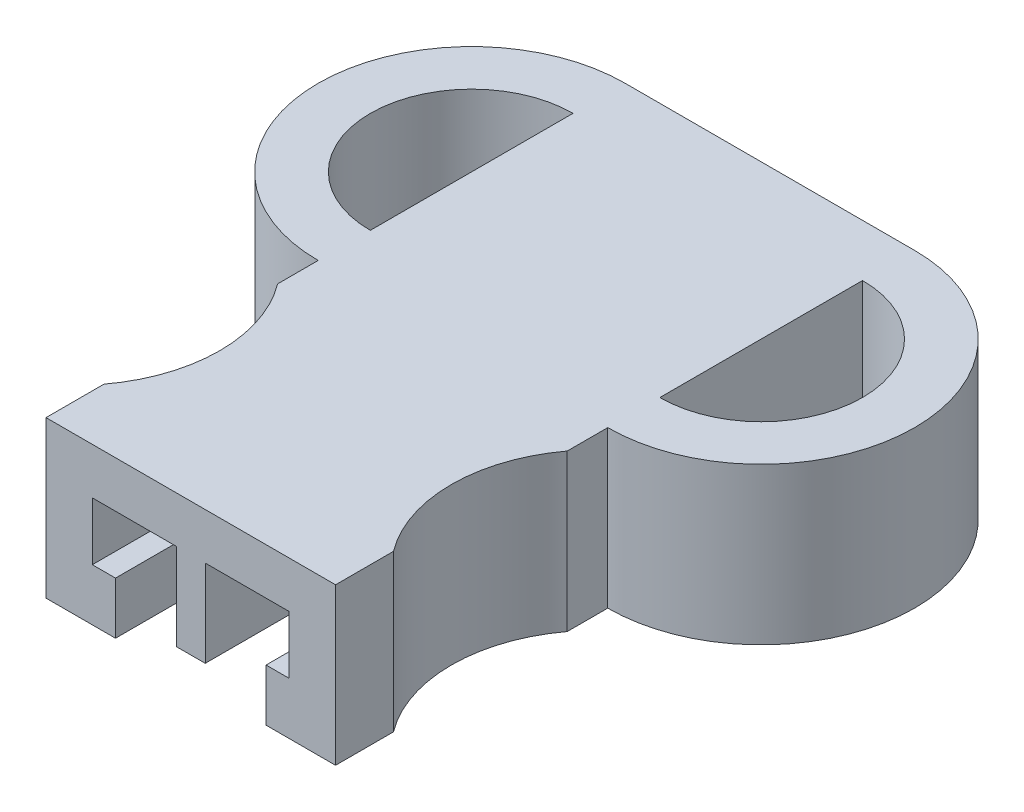
ISO-10303-21;
HEADER;
FILE_DESCRIPTION(('STEP AP214'),'2;1');
FILE_NAME('part.step','',(''),(''),'','','');
FILE_SCHEMA(('AUTOMOTIVE_DESIGN { 1 0 10303 214 1 1 1 1 }'));
ENDSEC;
DATA;
#1=APPLICATION_CONTEXT('core data for automotive mechanical design processes');
#2=APPLICATION_PROTOCOL_DEFINITION('international standard','automotive_design',2000,#1);
#3=PRODUCT_CONTEXT('',#1,'mechanical');
#4=PRODUCT('Part','Part','',(#3));
#5=PRODUCT_RELATED_PRODUCT_CATEGORY('part','',(#4));
#6=PRODUCT_DEFINITION_FORMATION('','',#4);
#7=PRODUCT_DEFINITION_CONTEXT('part definition',#1,'design');
#8=PRODUCT_DEFINITION('design','',#6,#7);
#9=PRODUCT_DEFINITION_SHAPE('','',#8);
#10=(LENGTH_UNIT() NAMED_UNIT(*) SI_UNIT(.MILLI.,.METRE.));
#11=(NAMED_UNIT(*) PLANE_ANGLE_UNIT() SI_UNIT($,.RADIAN.));
#12=(NAMED_UNIT(*) SI_UNIT($,.STERADIAN.) SOLID_ANGLE_UNIT());
#13=UNCERTAINTY_MEASURE_WITH_UNIT(LENGTH_MEASURE(1.E-05),#10,'distance_accuracy_value','');
#14=(GEOMETRIC_REPRESENTATION_CONTEXT(3) GLOBAL_UNCERTAINTY_ASSIGNED_CONTEXT((#13)) GLOBAL_UNIT_ASSIGNED_CONTEXT((#10,
#11,#12)) REPRESENTATION_CONTEXT('',''));
#15=CARTESIAN_POINT('',(0.,0.,0.));
#16=DIRECTION('',(0.,0.,1.));
#17=DIRECTION('',(1.,0.,0.));
#18=AXIS2_PLACEMENT_3D('',#15,#16,#17);
#19=CARTESIAN_POINT('',(0.,6.858,0.));
#20=DIRECTION('',(1.,0.,0.));
#21=DIRECTION('',(0.,0.,-1.));
#22=AXIS2_PLACEMENT_3D('',#19,#20,#21);
#23=PLANE('',#22);
#24=DIRECTION('',(0.,0.,1.));
#25=VECTOR('',#24,1.);
#26=CARTESIAN_POINT('',(0.,6.858,0.));
#27=LINE('',#26,#25);
#28=CARTESIAN_POINT('',(0.,6.858,13.462));
#29=VERTEX_POINT('',#28);
#30=CARTESIAN_POINT('',(0.,6.858,15.24));
#31=VERTEX_POINT('',#30);
#32=EDGE_CURVE('E247',#29,#31,#27,.T.);
#33=ORIENTED_EDGE('',*,*,#32,.F.);
#34=DIRECTION('',(0.,1.,0.));
#35=VECTOR('',#34,1.);
#36=CARTESIAN_POINT('',(0.,0.,13.462));
#37=LINE('',#36,#35);
#38=CARTESIAN_POINT('',(0.,0.,13.462));
#39=VERTEX_POINT('',#38);
#40=EDGE_CURVE('E336',#39,#29,#37,.T.);
#41=ORIENTED_EDGE('',*,*,#40,.F.);
#42=DIRECTION('',(0.,0.,1.));
#43=VECTOR('',#42,1.);
#44=CARTESIAN_POINT('',(0.,0.,0.));
#45=LINE('',#44,#43);
#46=CARTESIAN_POINT('',(0.,0.,15.24));
#47=VERTEX_POINT('',#46);
#48=EDGE_CURVE('E268',#39,#47,#45,.T.);
#49=ORIENTED_EDGE('',*,*,#48,.T.);
#50=DIRECTION('',(0.,-1.,0.));
#51=VECTOR('',#50,1.);
#52=CARTESIAN_POINT('',(0.,6.858,15.24));
#53=LINE('',#52,#51);
#54=EDGE_CURVE('E11',#31,#47,#53,.T.);
#55=ORIENTED_EDGE('',*,*,#54,.F.);
#56=EDGE_LOOP('',(#33,#41,#49,#55));
#57=FACE_BOUND('',#56,.T.);
#58=ADVANCED_FACE('F35',(#57),#23,.F.);
#59=CARTESIAN_POINT('',(12.7,6.858,0.));
#60=DIRECTION('',(-1.,0.,0.));
#61=DIRECTION('',(0.,0.,1.));
#62=AXIS2_PLACEMENT_3D('',#59,#60,#61);
#63=PLANE('',#62);
#64=DIRECTION('',(0.,0.,-1.));
#65=VECTOR('',#64,1.);
#66=CARTESIAN_POINT('',(12.7,6.858,0.));
#67=LINE('',#66,#65);
#68=CARTESIAN_POINT('',(12.7,6.858,11.176));
#69=VERTEX_POINT('',#68);
#70=CARTESIAN_POINT('',(12.7,6.858,2.286));
#71=VERTEX_POINT('',#70);
#72=EDGE_CURVE('E261',#69,#71,#67,.T.);
#73=ORIENTED_EDGE('',*,*,#72,.F.);
#74=DIRECTION('',(0.,1.,0.));
#75=VECTOR('',#74,1.);
#76=CARTESIAN_POINT('',(12.7000000000001,0.,11.176));
#77=LINE('',#76,#75);
#78=CARTESIAN_POINT('',(12.7000000000001,0.,11.176));
#79=VERTEX_POINT('',#78);
#80=EDGE_CURVE('E424',#79,#69,#77,.T.);
#81=ORIENTED_EDGE('',*,*,#80,.F.);
#82=DIRECTION('',(0.,0.,-1.));
#83=VECTOR('',#82,1.);
#84=CARTESIAN_POINT('',(12.7,0.,0.));
#85=LINE('',#84,#83);
#86=CARTESIAN_POINT('',(12.7,0.,2.286));
#87=VERTEX_POINT('',#86);
#88=EDGE_CURVE('E284',#79,#87,#85,.T.);
#89=ORIENTED_EDGE('',*,*,#88,.T.);
#90=DIRECTION('',(0.,1.,0.));
#91=VECTOR('',#90,1.);
#92=CARTESIAN_POINT('',(12.7,0.,2.286));
#93=LINE('',#92,#91);
#94=EDGE_CURVE('E363',#87,#71,#93,.T.);
#95=ORIENTED_EDGE('',*,*,#94,.T.);
#96=EDGE_LOOP('',(#73,#81,#89,#95));
#97=FACE_BOUND('',#96,.T.);
#98=ADVANCED_FACE('F462',(#97),#63,.F.);
#99=CARTESIAN_POINT('',(-5.08,0.,19.05));
#100=DIRECTION('',(0.,1.,0.));
#101=DIRECTION('',(0.,0.,1.));
#102=AXIS2_PLACEMENT_3D('',#99,#100,#101);
#103=PLANE('',#102);
#104=CARTESIAN_POINT('',(0.,0.,2.286));
#105=VERTEX_POINT('',#104);
#106=CARTESIAN_POINT('',(0.,0.,11.176));
#107=VERTEX_POINT('',#106);
#108=EDGE_CURVE('E270',#105,#107,#45,.T.);
#109=ORIENTED_EDGE('',*,*,#108,.F.);
#110=CARTESIAN_POINT('',(0.,0.,6.731));
#111=DIRECTION('',(0.,-1.,0.));
#112=DIRECTION('',(0.,0.,1.));
#113=AXIS2_PLACEMENT_3D('',#110,#111,#112);
#114=CIRCLE('',#113,4.445);
#115=EDGE_CURVE('E341',#107,#105,#114,.T.);
#116=ORIENTED_EDGE('',*,*,#115,.F.);
#117=EDGE_LOOP('',(#109,#116));
#118=FACE_BOUND('',#117,.T.);
#119=DIRECTION('',(-1.,0.,0.));
#120=VECTOR('',#119,1.);
#121=CARTESIAN_POINT('',(0.,0.,0.));
#122=LINE('',#121,#120);
#123=CARTESIAN_POINT('',(3.048,0.,0.));
#124=VERTEX_POINT('',#123);
#125=CARTESIAN_POINT('',(0.,0.,0.));
#126=VERTEX_POINT('',#125);
#127=EDGE_CURVE('E287',#124,#126,#122,.T.);
#128=ORIENTED_EDGE('',*,*,#127,.F.);
#129=DIRECTION('',(0.,0.,1.));
#130=VECTOR('',#129,1.);
#131=CARTESIAN_POINT('',(3.048,0.,0.));
#132=LINE('',#131,#130);
#133=CARTESIAN_POINT('',(3.048,0.,25.4));
#134=VERTEX_POINT('',#133);
#135=EDGE_CURVE('E271',#124,#134,#132,.T.);
#136=ORIENTED_EDGE('',*,*,#135,.T.);
#137=DIRECTION('',(1.,0.,0.));
#138=VECTOR('',#137,1.);
#139=CARTESIAN_POINT('',(0.,0.,25.4));
#140=LINE('',#139,#138);
#141=CARTESIAN_POINT('',(0.,0.,25.4));
#142=VERTEX_POINT('',#141);
#143=EDGE_CURVE('E277',#142,#134,#140,.T.);
#144=ORIENTED_EDGE('',*,*,#143,.F.);
#145=DIRECTION('',(0.,0.,1.));
#146=VECTOR('',#145,1.);
#147=CARTESIAN_POINT('',(0.,0.,22.86));
#148=LINE('',#147,#146);
#149=CARTESIAN_POINT('',(0.,0.,22.86));
#150=VERTEX_POINT('',#149);
#151=EDGE_CURVE('E274',#150,#142,#148,.T.);
#152=ORIENTED_EDGE('',*,*,#151,.F.);
#153=CARTESIAN_POINT('',(-5.08,0.,19.05));
#154=DIRECTION('',(0.,-1.,0.));
#155=DIRECTION('',(0.,0.,1.));
#156=AXIS2_PLACEMENT_3D('',#153,#154,#155);
#157=CIRCLE('',#156,6.35);
#158=EDGE_CURVE('E272',#47,#150,#157,.T.);
#159=ORIENTED_EDGE('',*,*,#158,.F.);
#160=ORIENTED_EDGE('',*,*,#48,.F.);
#161=CARTESIAN_POINT('',(0.,0.,6.731));
#162=DIRECTION('',(0.,1.,0.));
#163=DIRECTION('',(0.,0.,1.));
#164=AXIS2_PLACEMENT_3D('',#161,#162,#163);
#165=CIRCLE('',#164,6.731);
#166=EDGE_CURVE('E338',#126,#39,#165,.T.);
#167=ORIENTED_EDGE('',*,*,#166,.F.);
#168=EDGE_LOOP('',(#128,#136,#144,#152,#159,#160,#167));
#169=FACE_BOUND('',#168,.T.);
#170=ADVANCED_FACE('F318',(#118,#169),#103,.F.);
#171=CARTESIAN_POINT('',(0.,6.858,2.286));
#172=VERTEX_POINT('',#171);
#173=CARTESIAN_POINT('',(0.,6.858,11.176));
#174=VERTEX_POINT('',#173);
#175=EDGE_CURVE('E249',#172,#174,#27,.T.);
#176=ORIENTED_EDGE('',*,*,#175,.F.);
#177=DIRECTION('',(0.,1.,0.));
#178=VECTOR('',#177,1.);
#179=CARTESIAN_POINT('',(0.,0.,2.286));
#180=LINE('',#179,#178);
#181=EDGE_CURVE('E438',#105,#172,#180,.T.);
#182=ORIENTED_EDGE('',*,*,#181,.F.);
#183=ORIENTED_EDGE('',*,*,#108,.T.);
#184=DIRECTION('',(0.,1.,0.));
#185=VECTOR('',#184,1.);
#186=CARTESIAN_POINT('',(0.,0.,11.176));
#187=LINE('',#186,#185);
#188=EDGE_CURVE('E444',#107,#174,#187,.T.);
#189=ORIENTED_EDGE('',*,*,#188,.T.);
#190=EDGE_LOOP('',(#176,#182,#183,#189));
#191=FACE_BOUND('',#190,.T.);
#192=ADVANCED_FACE('F37',(#191),#23,.F.);
#193=CARTESIAN_POINT('',(-5.08,6.858,19.05));
#194=DIRECTION('',(0.,-1.,0.));
#195=DIRECTION('',(0.,0.,-1.));
#196=AXIS2_PLACEMENT_3D('',#193,#194,#195);
#197=CYLINDRICAL_SURFACE('',#196,6.35);
#198=ORIENTED_EDGE('',*,*,#158,.T.);
#199=DIRECTION('',(0.,-1.,0.));
#200=VECTOR('',#199,1.);
#201=CARTESIAN_POINT('',(0.,6.858,22.86));
#202=LINE('',#201,#200);
#203=CARTESIAN_POINT('',(0.,6.858,22.86));
#204=VERTEX_POINT('',#203);
#205=EDGE_CURVE('E43',#204,#150,#202,.T.);
#206=ORIENTED_EDGE('',*,*,#205,.F.);
#207=CARTESIAN_POINT('',(-5.08,6.858,19.05));
#208=DIRECTION('',(0.,-1.,0.));
#209=DIRECTION('',(0.,0.,1.));
#210=AXIS2_PLACEMENT_3D('',#207,#208,#209);
#211=CIRCLE('',#210,6.35);
#212=EDGE_CURVE('E251',#31,#204,#211,.T.);
#213=ORIENTED_EDGE('',*,*,#212,.F.);
#214=ORIENTED_EDGE('',*,*,#54,.T.);
#215=EDGE_LOOP('',(#198,#206,#213,#214));
#216=FACE_BOUND('',#215,.T.);
#217=ADVANCED_FACE('F333',(#216),#197,.F.);
#218=CARTESIAN_POINT('',(0.,6.858,22.86));
#219=DIRECTION('',(1.,0.,0.));
#220=DIRECTION('',(0.,0.,-1.));
#221=AXIS2_PLACEMENT_3D('',#218,#219,#220);
#222=PLANE('',#221);
#223=ORIENTED_EDGE('',*,*,#151,.T.);
#224=DIRECTION('',(0.,-1.,0.));
#225=VECTOR('',#224,1.);
#226=CARTESIAN_POINT('',(0.,6.858,25.4));
#227=LINE('',#226,#225);
#228=CARTESIAN_POINT('',(0.,6.858,25.4));
#229=VERTEX_POINT('',#228);
#230=EDGE_CURVE('E303',#229,#142,#227,.T.);
#231=ORIENTED_EDGE('',*,*,#230,.F.);
#232=DIRECTION('',(0.,0.,1.));
#233=VECTOR('',#232,1.);
#234=CARTESIAN_POINT('',(0.,6.858,22.86));
#235=LINE('',#234,#233);
#236=EDGE_CURVE('E253',#204,#229,#235,.T.);
#237=ORIENTED_EDGE('',*,*,#236,.F.);
#238=ORIENTED_EDGE('',*,*,#205,.T.);
#239=EDGE_LOOP('',(#223,#231,#237,#238));
#240=FACE_BOUND('',#239,.T.);
#241=ADVANCED_FACE('F310',(#240),#222,.F.);
#242=CARTESIAN_POINT('',(0.,6.858,25.4));
#243=DIRECTION('',(0.,0.,-1.));
#244=DIRECTION('',(-1.,0.,0.));
#245=AXIS2_PLACEMENT_3D('',#242,#243,#244);
#246=PLANE('',#245);
#247=ORIENTED_EDGE('',*,*,#143,.T.);
#248=DIRECTION('',(0.,-1.,0.));
#249=VECTOR('',#248,1.);
#250=CARTESIAN_POINT('',(3.048,0.,25.4));
#251=LINE('',#250,#249);
#252=CARTESIAN_POINT('',(3.048,2.286,25.4));
#253=VERTEX_POINT('',#252);
#254=EDGE_CURVE('E325',#253,#134,#251,.T.);
#255=ORIENTED_EDGE('',*,*,#254,.F.);
#256=DIRECTION('',(1.,0.,0.));
#257=VECTOR('',#256,1.);
#258=CARTESIAN_POINT('',(3.048,2.286,25.4));
#259=LINE('',#258,#257);
#260=CARTESIAN_POINT('',(2.032,2.286,25.4));
#261=VERTEX_POINT('',#260);
#262=EDGE_CURVE('E384',#261,#253,#259,.T.);
#263=ORIENTED_EDGE('',*,*,#262,.F.);
#264=DIRECTION('',(0.,-1.,0.));
#265=VECTOR('',#264,1.);
#266=CARTESIAN_POINT('',(2.032,2.286,25.4));
#267=LINE('',#266,#265);
#268=CARTESIAN_POINT('',(2.032,4.826,25.4));
#269=VERTEX_POINT('',#268);
#270=EDGE_CURVE('E381',#269,#261,#267,.T.);
#271=ORIENTED_EDGE('',*,*,#270,.F.);
#272=DIRECTION('',(-1.,0.,0.));
#273=VECTOR('',#272,1.);
#274=CARTESIAN_POINT('',(2.032,4.826,25.4));
#275=LINE('',#274,#273);
#276=CARTESIAN_POINT('',(5.715,4.826,25.4));
#277=VERTEX_POINT('',#276);
#278=EDGE_CURVE('E378',#277,#269,#275,.T.);
#279=ORIENTED_EDGE('',*,*,#278,.F.);
#280=DIRECTION('',(0.,1.,0.));
#281=VECTOR('',#280,1.);
#282=CARTESIAN_POINT('',(5.715,4.826,25.4));
#283=LINE('',#282,#281);
#284=CARTESIAN_POINT('',(5.715,1.016,25.4));
#285=VERTEX_POINT('',#284);
#286=EDGE_CURVE('E375',#285,#277,#283,.T.);
#287=ORIENTED_EDGE('',*,*,#286,.F.);
#288=DIRECTION('',(-1.,0.,0.));
#289=VECTOR('',#288,1.);
#290=CARTESIAN_POINT('',(5.715,1.016,25.4));
#291=LINE('',#290,#289);
#292=CARTESIAN_POINT('',(6.985,1.016,25.4));
#293=VERTEX_POINT('',#292);
#294=EDGE_CURVE('E373',#293,#285,#291,.T.);
#295=ORIENTED_EDGE('',*,*,#294,.F.);
#296=DIRECTION('',(0.,-1.,0.));
#297=VECTOR('',#296,1.);
#298=CARTESIAN_POINT('',(6.985,4.826,25.4));
#299=LINE('',#298,#297);
#300=CARTESIAN_POINT('',(6.985,4.826,25.4));
#301=VERTEX_POINT('',#300);
#302=EDGE_CURVE('E229',#301,#293,#299,.T.);
#303=ORIENTED_EDGE('',*,*,#302,.F.);
#304=DIRECTION('',(-1.,0.,0.));
#305=VECTOR('',#304,1.);
#306=CARTESIAN_POINT('',(6.985,4.826,25.4));
#307=LINE('',#306,#305);
#308=CARTESIAN_POINT('',(10.668,4.826,25.4));
#309=VERTEX_POINT('',#308);
#310=EDGE_CURVE('E369',#309,#301,#307,.T.);
#311=ORIENTED_EDGE('',*,*,#310,.F.);
#312=DIRECTION('',(0.,1.,0.));
#313=VECTOR('',#312,1.);
#314=CARTESIAN_POINT('',(10.668,4.826,25.4));
#315=LINE('',#314,#313);
#316=CARTESIAN_POINT('',(10.668,2.286,25.4));
#317=VERTEX_POINT('',#316);
#318=EDGE_CURVE('E366',#317,#309,#315,.T.);
#319=ORIENTED_EDGE('',*,*,#318,.F.);
#320=DIRECTION('',(1.,0.,0.));
#321=VECTOR('',#320,1.);
#322=CARTESIAN_POINT('',(10.668,2.286,25.4));
#323=LINE('',#322,#321);
#324=CARTESIAN_POINT('',(9.65200000000001,2.286,25.4));
#325=VERTEX_POINT('',#324);
#326=EDGE_CURVE('E362',#325,#317,#323,.T.);
#327=ORIENTED_EDGE('',*,*,#326,.F.);
#328=DIRECTION('',(0.,1.,0.));
#329=VECTOR('',#328,1.);
#330=CARTESIAN_POINT('',(9.65200000000001,2.286,25.4));
#331=LINE('',#330,#329);
#332=CARTESIAN_POINT('',(9.65200000000001,0.,25.4));
#333=VERTEX_POINT('',#332);
#334=EDGE_CURVE('E359',#333,#325,#331,.T.);
#335=ORIENTED_EDGE('',*,*,#334,.F.);
#336=CARTESIAN_POINT('',(12.7,0.,25.4));
#337=VERTEX_POINT('',#336);
#338=EDGE_CURVE('E276',#333,#337,#140,.T.);
#339=ORIENTED_EDGE('',*,*,#338,.T.);
#340=DIRECTION('',(0.,-1.,0.));
#341=VECTOR('',#340,1.);
#342=CARTESIAN_POINT('',(12.7,6.858,25.4));
#343=LINE('',#342,#341);
#344=CARTESIAN_POINT('',(12.7,6.858,25.4));
#345=VERTEX_POINT('',#344);
#346=EDGE_CURVE('E300',#345,#337,#343,.T.);
#347=ORIENTED_EDGE('',*,*,#346,.F.);
#348=DIRECTION('',(1.,0.,0.));
#349=VECTOR('',#348,1.);
#350=CARTESIAN_POINT('',(0.,6.858,25.4));
#351=LINE('',#350,#349);
#352=EDGE_CURVE('E255',#229,#345,#351,.T.);
#353=ORIENTED_EDGE('',*,*,#352,.F.);
#354=ORIENTED_EDGE('',*,*,#230,.T.);
#355=EDGE_LOOP('',(#247,#255,#263,#271,#279,#287,#295,#303,#311,#319,#327,#335,#339,#347,#353,#354));
#356=FACE_BOUND('',#355,.T.);
#357=ADVANCED_FACE('F323',(#356),#246,.F.);
#358=CARTESIAN_POINT('',(12.7,6.858,22.86));
#359=DIRECTION('',(-1.,0.,0.));
#360=DIRECTION('',(0.,0.,1.));
#361=AXIS2_PLACEMENT_3D('',#358,#359,#360);
#362=PLANE('',#361);
#363=DIRECTION('',(0.,0.,-1.));
#364=VECTOR('',#363,1.);
#365=CARTESIAN_POINT('',(12.7,0.,22.86));
#366=LINE('',#365,#364);
#367=CARTESIAN_POINT('',(12.7,0.,22.86));
#368=VERTEX_POINT('',#367);
#369=EDGE_CURVE('E280',#337,#368,#366,.T.);
#370=ORIENTED_EDGE('',*,*,#369,.T.);
#371=DIRECTION('',(0.,-1.,0.));
#372=VECTOR('',#371,1.);
#373=CARTESIAN_POINT('',(12.7,6.858,22.86));
#374=LINE('',#373,#372);
#375=CARTESIAN_POINT('',(12.7,6.858,22.86));
#376=VERTEX_POINT('',#375);
#377=EDGE_CURVE('E297',#376,#368,#374,.T.);
#378=ORIENTED_EDGE('',*,*,#377,.F.);
#379=DIRECTION('',(0.,0.,-1.));
#380=VECTOR('',#379,1.);
#381=CARTESIAN_POINT('',(12.7,6.858,22.86));
#382=LINE('',#381,#380);
#383=EDGE_CURVE('E257',#345,#376,#382,.T.);
#384=ORIENTED_EDGE('',*,*,#383,.F.);
#385=ORIENTED_EDGE('',*,*,#346,.T.);
#386=EDGE_LOOP('',(#370,#378,#384,#385));
#387=FACE_BOUND('',#386,.T.);
#388=ADVANCED_FACE('F645',(#387),#362,.F.);
#389=CARTESIAN_POINT('',(17.78,6.858,19.05));
#390=DIRECTION('',(0.,-1.,0.));
#391=DIRECTION('',(0.,0.,-1.));
#392=AXIS2_PLACEMENT_3D('',#389,#390,#391);
#393=CYLINDRICAL_SURFACE('',#392,6.35);
#394=CARTESIAN_POINT('',(17.78,0.,19.05));
#395=DIRECTION('',(0.,-1.,0.));
#396=DIRECTION('',(0.,0.,1.));
#397=AXIS2_PLACEMENT_3D('',#394,#395,#396);
#398=CIRCLE('',#397,6.35);
#399=CARTESIAN_POINT('',(12.7,0.,15.24));
#400=VERTEX_POINT('',#399);
#401=EDGE_CURVE('E282',#368,#400,#398,.T.);
#402=ORIENTED_EDGE('',*,*,#401,.T.);
#403=DIRECTION('',(0.,-1.,0.));
#404=VECTOR('',#403,1.);
#405=CARTESIAN_POINT('',(12.7,6.858,15.24));
#406=LINE('',#405,#404);
#407=CARTESIAN_POINT('',(12.7,6.858,15.24));
#408=VERTEX_POINT('',#407);
#409=EDGE_CURVE('E294',#408,#400,#406,.T.);
#410=ORIENTED_EDGE('',*,*,#409,.F.);
#411=CARTESIAN_POINT('',(17.78,6.858,19.05));
#412=DIRECTION('',(0.,-1.,0.));
#413=DIRECTION('',(0.,0.,1.));
#414=AXIS2_PLACEMENT_3D('',#411,#412,#413);
#415=CIRCLE('',#414,6.35);
#416=EDGE_CURVE('E259',#376,#408,#415,.T.);
#417=ORIENTED_EDGE('',*,*,#416,.F.);
#418=ORIENTED_EDGE('',*,*,#377,.T.);
#419=EDGE_LOOP('',(#402,#410,#417,#418));
#420=FACE_BOUND('',#419,.T.);
#421=ADVANCED_FACE('F509',(#420),#393,.F.);
#422=CARTESIAN_POINT('',(12.7,0.,13.462));
#423=VERTEX_POINT('',#422);
#424=EDGE_CURVE('E285',#400,#423,#85,.T.);
#425=ORIENTED_EDGE('',*,*,#424,.T.);
#426=DIRECTION('',(0.,1.,0.));
#427=VECTOR('',#426,1.);
#428=CARTESIAN_POINT('',(12.7000000000001,0.,13.462));
#429=LINE('',#428,#427);
#430=CARTESIAN_POINT('',(12.7,6.858,13.462));
#431=VERTEX_POINT('',#430);
#432=EDGE_CURVE('E427',#423,#431,#429,.T.);
#433=ORIENTED_EDGE('',*,*,#432,.T.);
#434=EDGE_CURVE('E262',#408,#431,#67,.T.);
#435=ORIENTED_EDGE('',*,*,#434,.F.);
#436=ORIENTED_EDGE('',*,*,#409,.T.);
#437=EDGE_LOOP('',(#425,#433,#435,#436));
#438=FACE_BOUND('',#437,.T.);
#439=ADVANCED_FACE('F471',(#438),#63,.F.);
#440=CARTESIAN_POINT('',(0.,6.858,0.));
#441=DIRECTION('',(0.,0.,1.));
#442=DIRECTION('',(1.,0.,0.));
#443=AXIS2_PLACEMENT_3D('',#440,#441,#442);
#444=PLANE('',#443);
#445=DIRECTION('',(0.,1.,0.));
#446=VECTOR('',#445,1.);
#447=CARTESIAN_POINT('',(10.668,4.826,0.));
#448=LINE('',#447,#446);
#449=CARTESIAN_POINT('',(10.668,2.286,0.));
#450=VERTEX_POINT('',#449);
#451=CARTESIAN_POINT('',(10.668,4.826,0.));
#452=VERTEX_POINT('',#451);
#453=EDGE_CURVE('E409',#450,#452,#448,.T.);
#454=ORIENTED_EDGE('',*,*,#453,.T.);
#455=DIRECTION('',(-1.,0.,0.));
#456=VECTOR('',#455,1.);
#457=CARTESIAN_POINT('',(2.032,4.826,0.));
#458=LINE('',#457,#456);
#459=CARTESIAN_POINT('',(2.032,4.826,0.));
#460=VERTEX_POINT('',#459);
#461=EDGE_CURVE('E407',#452,#460,#458,.T.);
#462=ORIENTED_EDGE('',*,*,#461,.T.);
#463=DIRECTION('',(0.,-1.,0.));
#464=VECTOR('',#463,1.);
#465=CARTESIAN_POINT('',(2.032,2.286,0.));
#466=LINE('',#465,#464);
#467=CARTESIAN_POINT('',(2.032,2.286,0.));
#468=VERTEX_POINT('',#467);
#469=EDGE_CURVE('E355',#460,#468,#466,.T.);
#470=ORIENTED_EDGE('',*,*,#469,.T.);
#471=DIRECTION('',(1.,0.,0.));
#472=VECTOR('',#471,1.);
#473=CARTESIAN_POINT('',(3.048,2.286,0.));
#474=LINE('',#473,#472);
#475=CARTESIAN_POINT('',(3.048,2.286,0.));
#476=VERTEX_POINT('',#475);
#477=EDGE_CURVE('E352',#468,#476,#474,.T.);
#478=ORIENTED_EDGE('',*,*,#477,.T.);
#479=DIRECTION('',(0.,-1.,0.));
#480=VECTOR('',#479,1.);
#481=CARTESIAN_POINT('',(3.048,0.,0.));
#482=LINE('',#481,#480);
#483=EDGE_CURVE('E246',#476,#124,#482,.T.);
#484=ORIENTED_EDGE('',*,*,#483,.T.);
#485=ORIENTED_EDGE('',*,*,#127,.T.);
#486=DIRECTION('',(0.,-1.,0.));
#487=VECTOR('',#486,1.);
#488=CARTESIAN_POINT('',(0.,6.858,0.));
#489=LINE('',#488,#487);
#490=CARTESIAN_POINT('',(0.,6.858,0.));
#491=VERTEX_POINT('',#490);
#492=EDGE_CURVE('E267',#491,#126,#489,.T.);
#493=ORIENTED_EDGE('',*,*,#492,.F.);
#494=DIRECTION('',(-1.,0.,0.));
#495=VECTOR('',#494,1.);
#496=CARTESIAN_POINT('',(0.,6.858,0.));
#497=LINE('',#496,#495);
#498=CARTESIAN_POINT('',(12.7,6.858,0.));
#499=VERTEX_POINT('',#498);
#500=EDGE_CURVE('E265',#499,#491,#497,.T.);
#501=ORIENTED_EDGE('',*,*,#500,.F.);
#502=DIRECTION('',(0.,-1.,0.));
#503=VECTOR('',#502,1.);
#504=CARTESIAN_POINT('',(12.7,6.858,0.));
#505=LINE('',#504,#503);
#506=CARTESIAN_POINT('',(12.7,0.,0.));
#507=VERTEX_POINT('',#506);
#508=EDGE_CURVE('E291',#499,#507,#505,.T.);
#509=ORIENTED_EDGE('',*,*,#508,.T.);
#510=CARTESIAN_POINT('',(9.65200000000001,0.,0.));
#511=VERTEX_POINT('',#510);
#512=EDGE_CURVE('E250',#507,#511,#122,.T.);
#513=ORIENTED_EDGE('',*,*,#512,.T.);
#514=DIRECTION('',(0.,1.,0.));
#515=VECTOR('',#514,1.);
#516=CARTESIAN_POINT('',(9.65200000000001,2.286,0.));
#517=LINE('',#516,#515);
#518=CARTESIAN_POINT('',(9.65200000000001,2.286,0.));
#519=VERTEX_POINT('',#518);
#520=EDGE_CURVE('E388',#511,#519,#517,.T.);
#521=ORIENTED_EDGE('',*,*,#520,.T.);
#522=DIRECTION('',(1.,0.,0.));
#523=VECTOR('',#522,1.);
#524=CARTESIAN_POINT('',(10.668,2.286,0.));
#525=LINE('',#524,#523);
#526=EDGE_CURVE('E419',#519,#450,#525,.T.);
#527=ORIENTED_EDGE('',*,*,#526,.T.);
#528=EDGE_LOOP('',(#454,#462,#470,#478,#484,#485,#493,#501,#509,#513,#521,#527));
#529=FACE_BOUND('',#528,.T.);
#530=ADVANCED_FACE('F347',(#529),#444,.F.);
#531=CARTESIAN_POINT('',(-5.08,6.858,19.05));
#532=DIRECTION('',(0.,1.,0.));
#533=DIRECTION('',(0.,0.,1.));
#534=AXIS2_PLACEMENT_3D('',#531,#532,#533);
#535=PLANE('',#534);
#536=CARTESIAN_POINT('',(0.,6.858,6.731));
#537=DIRECTION('',(0.,-1.,0.));
#538=DIRECTION('',(0.,0.,1.));
#539=AXIS2_PLACEMENT_3D('',#536,#537,#538);
#540=CIRCLE('',#539,4.445);
#541=EDGE_CURVE('E57',#174,#172,#540,.T.);
#542=ORIENTED_EDGE('',*,*,#541,.T.);
#543=ORIENTED_EDGE('',*,*,#175,.T.);
#544=EDGE_LOOP('',(#542,#543));
#545=FACE_BOUND('',#544,.T.);
#546=ORIENTED_EDGE('',*,*,#72,.T.);
#547=CARTESIAN_POINT('',(12.7,6.858,6.731));
#548=DIRECTION('',(0.,-1.,0.));
#549=DIRECTION('',(0.,0.,1.));
#550=AXIS2_PLACEMENT_3D('',#547,#548,#549);
#551=CIRCLE('',#550,4.445);
#552=EDGE_CURVE('E435',#71,#69,#551,.T.);
#553=ORIENTED_EDGE('',*,*,#552,.T.);
#554=EDGE_LOOP('',(#546,#553));
#555=FACE_BOUND('',#554,.T.);
#556=ORIENTED_EDGE('',*,*,#500,.T.);
#557=CARTESIAN_POINT('',(0.,6.858,6.731));
#558=DIRECTION('',(0.,1.,0.));
#559=DIRECTION('',(0.,0.,1.));
#560=AXIS2_PLACEMENT_3D('',#557,#558,#559);
#561=CIRCLE('',#560,6.731);
#562=EDGE_CURVE('E50',#491,#29,#561,.T.);
#563=ORIENTED_EDGE('',*,*,#562,.T.);
#564=ORIENTED_EDGE('',*,*,#32,.T.);
#565=ORIENTED_EDGE('',*,*,#212,.T.);
#566=ORIENTED_EDGE('',*,*,#236,.T.);
#567=ORIENTED_EDGE('',*,*,#352,.T.);
#568=ORIENTED_EDGE('',*,*,#383,.T.);
#569=ORIENTED_EDGE('',*,*,#416,.T.);
#570=ORIENTED_EDGE('',*,*,#434,.T.);
#571=CARTESIAN_POINT('',(12.7,6.858,6.731));
#572=DIRECTION('',(0.,1.,0.));
#573=DIRECTION('',(0.,0.,1.));
#574=AXIS2_PLACEMENT_3D('',#571,#572,#573);
#575=CIRCLE('',#574,6.731);
#576=EDGE_CURVE('E431',#431,#499,#575,.T.);
#577=ORIENTED_EDGE('',*,*,#576,.T.);
#578=EDGE_LOOP('',(#556,#563,#564,#565,#566,#567,#568,#569,#570,#577));
#579=FACE_BOUND('',#578,.T.);
#580=ADVANCED_FACE('F329',(#545,#555,#579),#535,.T.);
#581=CARTESIAN_POINT('',(12.7,0.,6.731));
#582=DIRECTION('',(0.,-1.,0.));
#583=DIRECTION('',(0.,0.,1.));
#584=AXIS2_PLACEMENT_3D('',#581,#582,#583);
#585=CIRCLE('',#584,4.445);
#586=EDGE_CURVE('E434',#87,#79,#585,.T.);
#587=ORIENTED_EDGE('',*,*,#586,.F.);
#588=ORIENTED_EDGE('',*,*,#88,.F.);
#589=EDGE_LOOP('',(#587,#588));
#590=FACE_BOUND('',#589,.T.);
#591=ORIENTED_EDGE('',*,*,#338,.F.);
#592=DIRECTION('',(0.,0.,1.));
#593=VECTOR('',#592,1.);
#594=CARTESIAN_POINT('',(9.65200000000001,0.,0.));
#595=LINE('',#594,#593);
#596=EDGE_CURVE('E244',#511,#333,#595,.T.);
#597=ORIENTED_EDGE('',*,*,#596,.F.);
#598=ORIENTED_EDGE('',*,*,#512,.F.);
#599=CARTESIAN_POINT('',(12.7,0.,6.731));
#600=DIRECTION('',(0.,1.,0.));
#601=DIRECTION('',(0.,0.,1.));
#602=AXIS2_PLACEMENT_3D('',#599,#600,#601);
#603=CIRCLE('',#602,6.731);
#604=EDGE_CURVE('E428',#423,#507,#603,.T.);
#605=ORIENTED_EDGE('',*,*,#604,.F.);
#606=ORIENTED_EDGE('',*,*,#424,.F.);
#607=ORIENTED_EDGE('',*,*,#401,.F.);
#608=ORIENTED_EDGE('',*,*,#369,.F.);
#609=EDGE_LOOP('',(#591,#597,#598,#605,#606,#607,#608));
#610=FACE_BOUND('',#609,.T.);
#611=ADVANCED_FACE('F464',(#590,#610),#103,.F.);
#612=CARTESIAN_POINT('',(3.048,0.,0.));
#613=DIRECTION('',(-1.,0.,0.));
#614=DIRECTION('',(0.,0.,1.));
#615=AXIS2_PLACEMENT_3D('',#612,#613,#614);
#616=PLANE('',#615);
#617=ORIENTED_EDGE('',*,*,#254,.T.);
#618=ORIENTED_EDGE('',*,*,#135,.F.);
#619=ORIENTED_EDGE('',*,*,#483,.F.);
#620=DIRECTION('',(0.,0.,1.));
#621=VECTOR('',#620,1.);
#622=CARTESIAN_POINT('',(3.048,2.286,0.));
#623=LINE('',#622,#621);
#624=EDGE_CURVE('E390',#476,#253,#623,.T.);
#625=ORIENTED_EDGE('',*,*,#624,.T.);
#626=EDGE_LOOP('',(#617,#618,#619,#625));
#627=FACE_BOUND('',#626,.T.);
#628=ADVANCED_FACE('F475',(#627),#616,.F.);
#629=CARTESIAN_POINT('',(3.048,2.286,0.));
#630=DIRECTION('',(0.,-1.,0.));
#631=DIRECTION('',(0.,0.,-1.));
#632=AXIS2_PLACEMENT_3D('',#629,#630,#631);
#633=PLANE('',#632);
#634=ORIENTED_EDGE('',*,*,#262,.T.);
#635=ORIENTED_EDGE('',*,*,#624,.F.);
#636=ORIENTED_EDGE('',*,*,#477,.F.);
#637=DIRECTION('',(0.,0.,1.));
#638=VECTOR('',#637,1.);
#639=CARTESIAN_POINT('',(2.032,2.286,0.));
#640=LINE('',#639,#638);
#641=EDGE_CURVE('E392',#468,#261,#640,.T.);
#642=ORIENTED_EDGE('',*,*,#641,.T.);
#643=EDGE_LOOP('',(#634,#635,#636,#642));
#644=FACE_BOUND('',#643,.T.);
#645=ADVANCED_FACE('F624',(#644),#633,.F.);
#646=CARTESIAN_POINT('',(2.032,2.286,0.));
#647=DIRECTION('',(-1.,0.,0.));
#648=DIRECTION('',(0.,-1.,0.));
#649=AXIS2_PLACEMENT_3D('',#646,#647,#648);
#650=PLANE('',#649);
#651=ORIENTED_EDGE('',*,*,#270,.T.);
#652=ORIENTED_EDGE('',*,*,#641,.F.);
#653=ORIENTED_EDGE('',*,*,#469,.F.);
#654=DIRECTION('',(0.,0.,1.));
#655=VECTOR('',#654,1.);
#656=CARTESIAN_POINT('',(2.032,4.826,0.));
#657=LINE('',#656,#655);
#658=EDGE_CURVE('E394',#460,#269,#657,.T.);
#659=ORIENTED_EDGE('',*,*,#658,.T.);
#660=EDGE_LOOP('',(#651,#652,#653,#659));
#661=FACE_BOUND('',#660,.T.);
#662=ADVANCED_FACE('F404',(#661),#650,.F.);
#663=CARTESIAN_POINT('',(2.032,4.826,0.));
#664=DIRECTION('',(0.,1.,0.));
#665=DIRECTION('',(-1.,0.,0.));
#666=AXIS2_PLACEMENT_3D('',#663,#664,#665);
#667=PLANE('',#666);
#668=ORIENTED_EDGE('',*,*,#278,.T.);
#669=ORIENTED_EDGE('',*,*,#658,.F.);
#670=ORIENTED_EDGE('',*,*,#461,.F.);
#671=DIRECTION('',(0.,0.,1.));
#672=VECTOR('',#671,1.);
#673=CARTESIAN_POINT('',(10.668,4.826,0.));
#674=LINE('',#673,#672);
#675=EDGE_CURVE('E235',#452,#309,#674,.T.);
#676=ORIENTED_EDGE('',*,*,#675,.T.);
#677=ORIENTED_EDGE('',*,*,#310,.T.);
#678=DIRECTION('',(0.,0.,1.));
#679=VECTOR('',#678,1.);
#680=CARTESIAN_POINT('',(6.985,4.826,0.));
#681=LINE('',#680,#679);
#682=CARTESIAN_POINT('',(6.985,4.826,6.35));
#683=VERTEX_POINT('',#682);
#684=EDGE_CURVE('E231',#683,#301,#681,.T.);
#685=ORIENTED_EDGE('',*,*,#684,.F.);
#686=DIRECTION('',(1.,0.,0.));
#687=VECTOR('',#686,1.);
#688=CARTESIAN_POINT('',(6.985,4.826,6.35));
#689=LINE('',#688,#687);
#690=CARTESIAN_POINT('',(5.715,4.826,6.35));
#691=VERTEX_POINT('',#690);
#692=EDGE_CURVE('E213',#691,#683,#689,.T.);
#693=ORIENTED_EDGE('',*,*,#692,.F.);
#694=DIRECTION('',(0.,0.,1.));
#695=VECTOR('',#694,1.);
#696=CARTESIAN_POINT('',(5.715,4.826,0.));
#697=LINE('',#696,#695);
#698=EDGE_CURVE('E233',#691,#277,#697,.T.);
#699=ORIENTED_EDGE('',*,*,#698,.T.);
#700=EDGE_LOOP('',(#668,#669,#670,#676,#677,#685,#693,#699));
#701=FACE_BOUND('',#700,.T.);
#702=ADVANCED_FACE('F397',(#701),#667,.F.);
#703=CARTESIAN_POINT('',(5.715,4.826,0.));
#704=DIRECTION('',(1.,0.,0.));
#705=DIRECTION('',(0.,0.,-1.));
#706=AXIS2_PLACEMENT_3D('',#703,#704,#705);
#707=PLANE('',#706);
#708=ORIENTED_EDGE('',*,*,#698,.F.);
#709=DIRECTION('',(0.,1.,0.));
#710=VECTOR('',#709,1.);
#711=CARTESIAN_POINT('',(5.715,1.016,6.35));
#712=LINE('',#711,#710);
#713=CARTESIAN_POINT('',(5.715,1.016,6.35));
#714=VERTEX_POINT('',#713);
#715=EDGE_CURVE('E225',#714,#691,#712,.T.);
#716=ORIENTED_EDGE('',*,*,#715,.F.);
#717=DIRECTION('',(0.,0.,1.));
#718=VECTOR('',#717,1.);
#719=CARTESIAN_POINT('',(5.715,1.016,0.));
#720=LINE('',#719,#718);
#721=EDGE_CURVE('E224',#714,#285,#720,.T.);
#722=ORIENTED_EDGE('',*,*,#721,.T.);
#723=ORIENTED_EDGE('',*,*,#286,.T.);
#724=EDGE_LOOP('',(#708,#716,#722,#723));
#725=FACE_BOUND('',#724,.T.);
#726=ADVANCED_FACE('F402',(#725),#707,.F.);
#727=CARTESIAN_POINT('',(5.715,1.016,0.));
#728=DIRECTION('',(0.,1.,0.));
#729=DIRECTION('',(0.,0.,1.));
#730=AXIS2_PLACEMENT_3D('',#727,#728,#729);
#731=PLANE('',#730);
#732=ORIENTED_EDGE('',*,*,#721,.F.);
#733=DIRECTION('',(-1.,0.,0.));
#734=VECTOR('',#733,1.);
#735=CARTESIAN_POINT('',(6.985,1.016,6.35));
#736=LINE('',#735,#734);
#737=CARTESIAN_POINT('',(6.985,1.016,6.35));
#738=VERTEX_POINT('',#737);
#739=EDGE_CURVE('E210',#738,#714,#736,.T.);
#740=ORIENTED_EDGE('',*,*,#739,.F.);
#741=DIRECTION('',(0.,0.,1.));
#742=VECTOR('',#741,1.);
#743=CARTESIAN_POINT('',(6.985,1.016,0.));
#744=LINE('',#743,#742);
#745=EDGE_CURVE('E222',#738,#293,#744,.T.);
#746=ORIENTED_EDGE('',*,*,#745,.T.);
#747=ORIENTED_EDGE('',*,*,#294,.T.);
#748=EDGE_LOOP('',(#732,#740,#746,#747));
#749=FACE_BOUND('',#748,.T.);
#750=ADVANCED_FACE('F220',(#749),#731,.F.);
#751=CARTESIAN_POINT('',(6.985,4.826,0.));
#752=DIRECTION('',(-1.,0.,0.));
#753=DIRECTION('',(0.,-1.,0.));
#754=AXIS2_PLACEMENT_3D('',#751,#752,#753);
#755=PLANE('',#754);
#756=ORIENTED_EDGE('',*,*,#745,.F.);
#757=DIRECTION('',(0.,-1.,0.));
#758=VECTOR('',#757,1.);
#759=CARTESIAN_POINT('',(6.985,1.016,6.35));
#760=LINE('',#759,#758);
#761=EDGE_CURVE('E207',#683,#738,#760,.T.);
#762=ORIENTED_EDGE('',*,*,#761,.F.);
#763=ORIENTED_EDGE('',*,*,#684,.T.);
#764=ORIENTED_EDGE('',*,*,#302,.T.);
#765=EDGE_LOOP('',(#756,#762,#763,#764));
#766=FACE_BOUND('',#765,.T.);
#767=ADVANCED_FACE('F227',(#766),#755,.F.);
#768=CARTESIAN_POINT('',(10.668,4.826,0.));
#769=DIRECTION('',(1.,0.,0.));
#770=DIRECTION('',(0.,0.,-1.));
#771=AXIS2_PLACEMENT_3D('',#768,#769,#770);
#772=PLANE('',#771);
#773=ORIENTED_EDGE('',*,*,#318,.T.);
#774=ORIENTED_EDGE('',*,*,#675,.F.);
#775=ORIENTED_EDGE('',*,*,#453,.F.);
#776=DIRECTION('',(0.,0.,1.));
#777=VECTOR('',#776,1.);
#778=CARTESIAN_POINT('',(10.668,2.286,0.));
#779=LINE('',#778,#777);
#780=EDGE_CURVE('E240',#450,#317,#779,.T.);
#781=ORIENTED_EDGE('',*,*,#780,.T.);
#782=EDGE_LOOP('',(#773,#774,#775,#781));
#783=FACE_BOUND('',#782,.T.);
#784=ADVANCED_FACE('F413',(#783),#772,.F.);
#785=CARTESIAN_POINT('',(10.668,2.286,0.));
#786=DIRECTION('',(0.,-1.,0.));
#787=DIRECTION('',(0.,0.,-1.));
#788=AXIS2_PLACEMENT_3D('',#785,#786,#787);
#789=PLANE('',#788);
#790=ORIENTED_EDGE('',*,*,#326,.T.);
#791=ORIENTED_EDGE('',*,*,#780,.F.);
#792=ORIENTED_EDGE('',*,*,#526,.F.);
#793=DIRECTION('',(0.,0.,1.));
#794=VECTOR('',#793,1.);
#795=CARTESIAN_POINT('',(9.65200000000001,2.286,0.));
#796=LINE('',#795,#794);
#797=EDGE_CURVE('E242',#519,#325,#796,.T.);
#798=ORIENTED_EDGE('',*,*,#797,.T.);
#799=EDGE_LOOP('',(#790,#791,#792,#798));
#800=FACE_BOUND('',#799,.T.);
#801=ADVANCED_FACE('F630',(#800),#789,.F.);
#802=CARTESIAN_POINT('',(9.65200000000001,2.286,0.));
#803=DIRECTION('',(1.,0.,0.));
#804=DIRECTION('',(0.,1.,0.));
#805=AXIS2_PLACEMENT_3D('',#802,#803,#804);
#806=PLANE('',#805);
#807=ORIENTED_EDGE('',*,*,#334,.T.);
#808=ORIENTED_EDGE('',*,*,#797,.F.);
#809=ORIENTED_EDGE('',*,*,#520,.F.);
#810=ORIENTED_EDGE('',*,*,#596,.T.);
#811=EDGE_LOOP('',(#807,#808,#809,#810));
#812=FACE_BOUND('',#811,.T.);
#813=ADVANCED_FACE('F539',(#812),#806,.F.);
#814=CARTESIAN_POINT('',(12.7,0.,6.731));
#815=DIRECTION('',(0.,1.,0.));
#816=DIRECTION('',(0.,0.,1.));
#817=AXIS2_PLACEMENT_3D('',#814,#815,#816);
#818=CYLINDRICAL_SURFACE('',#817,4.445);
#819=ORIENTED_EDGE('',*,*,#552,.F.);
#820=ORIENTED_EDGE('',*,*,#94,.F.);
#821=ORIENTED_EDGE('',*,*,#586,.T.);
#822=ORIENTED_EDGE('',*,*,#80,.T.);
#823=EDGE_LOOP('',(#819,#820,#821,#822));
#824=FACE_BOUND('',#823,.T.);
#825=ADVANCED_FACE('F534',(#824),#818,.F.);
#826=CARTESIAN_POINT('',(12.7,0.,6.731));
#827=DIRECTION('',(0.,1.,0.));
#828=DIRECTION('',(0.,0.,1.));
#829=AXIS2_PLACEMENT_3D('',#826,#827,#828);
#830=CYLINDRICAL_SURFACE('',#829,6.731);
#831=ORIENTED_EDGE('',*,*,#576,.F.);
#832=ORIENTED_EDGE('',*,*,#432,.F.);
#833=ORIENTED_EDGE('',*,*,#604,.T.);
#834=ORIENTED_EDGE('',*,*,#508,.F.);
#835=EDGE_LOOP('',(#831,#832,#833,#834));
#836=FACE_BOUND('',#835,.T.);
#837=ADVANCED_FACE('F538',(#836),#830,.T.);
#838=CARTESIAN_POINT('',(0.,0.,6.731));
#839=DIRECTION('',(0.,1.,0.));
#840=DIRECTION('',(0.,0.,1.));
#841=AXIS2_PLACEMENT_3D('',#838,#839,#840);
#842=CYLINDRICAL_SURFACE('',#841,6.731);
#843=ORIENTED_EDGE('',*,*,#562,.F.);
#844=ORIENTED_EDGE('',*,*,#492,.T.);
#845=ORIENTED_EDGE('',*,*,#166,.T.);
#846=ORIENTED_EDGE('',*,*,#40,.T.);
#847=EDGE_LOOP('',(#843,#844,#845,#846));
#848=FACE_BOUND('',#847,.T.);
#849=ADVANCED_FACE('F550',(#848),#842,.T.);
#850=CARTESIAN_POINT('',(0.,0.,6.731));
#851=DIRECTION('',(0.,1.,0.));
#852=DIRECTION('',(0.,0.,1.));
#853=AXIS2_PLACEMENT_3D('',#850,#851,#852);
#854=CYLINDRICAL_SURFACE('',#853,4.445);
#855=ORIENTED_EDGE('',*,*,#541,.F.);
#856=ORIENTED_EDGE('',*,*,#188,.F.);
#857=ORIENTED_EDGE('',*,*,#115,.T.);
#858=ORIENTED_EDGE('',*,*,#181,.T.);
#859=EDGE_LOOP('',(#855,#856,#857,#858));
#860=FACE_BOUND('',#859,.T.);
#861=ADVANCED_FACE('F455',(#860),#854,.F.);
#862=CARTESIAN_POINT('',(0.,0.,6.35));
#863=DIRECTION('',(0.,0.,1.));
#864=DIRECTION('',(1.,0.,0.));
#865=AXIS2_PLACEMENT_3D('',#862,#863,#864);
#866=PLANE('',#865);
#867=ORIENTED_EDGE('',*,*,#761,.T.);
#868=ORIENTED_EDGE('',*,*,#739,.T.);
#869=ORIENTED_EDGE('',*,*,#715,.T.);
#870=ORIENTED_EDGE('',*,*,#692,.T.);
#871=EDGE_LOOP('',(#867,#868,#869,#870));
#872=FACE_BOUND('',#871,.T.);
#873=ADVANCED_FACE('F209',(#872),#866,.F.);
#874=CLOSED_SHELL('',(#58,#98,#170,#192,#217,#241,#357,#388,#421,#439,#530,#580,#611,#628,#645,
#662,#702,#726,#750,#767,#784,#801,#813,#825,#837,#849,#861,#873));
#875=MANIFOLD_SOLID_BREP('B2',#874);
#876=ADVANCED_BREP_SHAPE_REPRESENTATION('',(#18,#875),#14);
#877=SHAPE_DEFINITION_REPRESENTATION(#9,#876);
ENDSEC;
END-ISO-10303-21;
